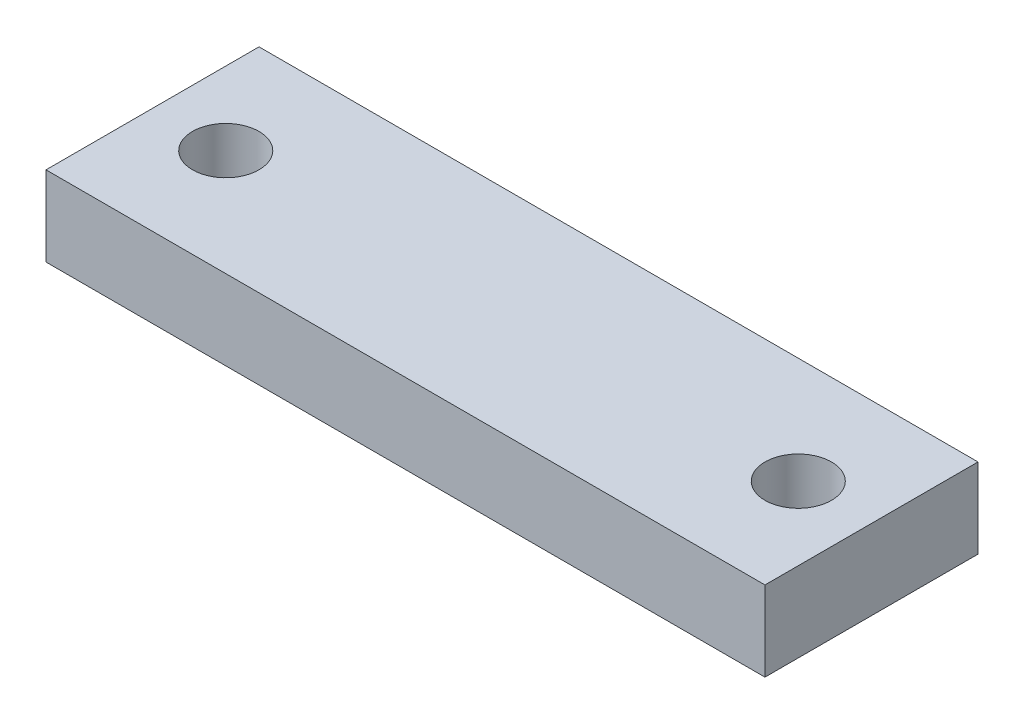
ISO-10303-21;
HEADER;
FILE_DESCRIPTION(('STEP AP214'),'2;1');
FILE_NAME('part.step','',(''),(''),'','','');
FILE_SCHEMA(('AUTOMOTIVE_DESIGN { 1 0 10303 214 1 1 1 1 }'));
ENDSEC;
DATA;
#1=APPLICATION_CONTEXT('core data for automotive mechanical design processes');
#2=APPLICATION_PROTOCOL_DEFINITION('international standard','automotive_design',2000,#1);
#3=PRODUCT_CONTEXT('',#1,'mechanical');
#4=PRODUCT('Part','Part','',(#3));
#5=PRODUCT_RELATED_PRODUCT_CATEGORY('part','',(#4));
#6=PRODUCT_DEFINITION_FORMATION('','',#4);
#7=PRODUCT_DEFINITION_CONTEXT('part definition',#1,'design');
#8=PRODUCT_DEFINITION('design','',#6,#7);
#9=PRODUCT_DEFINITION_SHAPE('','',#8);
#10=(LENGTH_UNIT() NAMED_UNIT(*) SI_UNIT(.MILLI.,.METRE.));
#11=(NAMED_UNIT(*) PLANE_ANGLE_UNIT() SI_UNIT($,.RADIAN.));
#12=(NAMED_UNIT(*) SI_UNIT($,.STERADIAN.) SOLID_ANGLE_UNIT());
#13=UNCERTAINTY_MEASURE_WITH_UNIT(LENGTH_MEASURE(1.E-05),#10,'distance_accuracy_value','');
#14=(GEOMETRIC_REPRESENTATION_CONTEXT(3) GLOBAL_UNCERTAINTY_ASSIGNED_CONTEXT((#13)) GLOBAL_UNIT_ASSIGNED_CONTEXT((#10,
#11,#12)) REPRESENTATION_CONTEXT('',''));
#15=CARTESIAN_POINT('',(0.,0.,0.));
#16=DIRECTION('',(0.,0.,1.));
#17=DIRECTION('',(1.,0.,0.));
#18=AXIS2_PLACEMENT_3D('',#15,#16,#17);
#19=CARTESIAN_POINT('',(0.,9.525,-25.4));
#20=DIRECTION('',(0.,-1.,0.));
#21=DIRECTION('',(0.,0.,-1.));
#22=AXIS2_PLACEMENT_3D('',#19,#20,#21);
#23=PLANE('',#22);
#24=CARTESIAN_POINT('',(76.99375,9.525,-12.7));
#25=DIRECTION('',(0.,1.,0.));
#26=DIRECTION('',(0.,0.,1.));
#27=AXIS2_PLACEMENT_3D('',#24,#25,#26);
#28=CIRCLE('',#27,3.96874999999999);
#29=CARTESIAN_POINT('',(76.99375,9.525,-8.73125000000002));
#30=VERTEX_POINT('',#29);
#31=EDGE_CURVE('E90',#30,#30,#28,.T.);
#32=ORIENTED_EDGE('',*,*,#31,.F.);
#33=EDGE_LOOP('',(#32));
#34=FACE_BOUND('',#33,.T.);
#35=DIRECTION('',(0.,0.,1.));
#36=VECTOR('',#35,1.);
#37=CARTESIAN_POINT('',(0.,9.525,0.));
#38=LINE('',#37,#36);
#39=CARTESIAN_POINT('',(0.,9.525,-25.4));
#40=VERTEX_POINT('',#39);
#41=CARTESIAN_POINT('',(0.,9.525,0.));
#42=VERTEX_POINT('',#41);
#43=EDGE_CURVE('E100',#40,#42,#38,.T.);
#44=ORIENTED_EDGE('',*,*,#43,.T.);
#45=DIRECTION('',(1.,0.,0.));
#46=VECTOR('',#45,1.);
#47=CARTESIAN_POINT('',(0.,9.525,0.));
#48=LINE('',#47,#46);
#49=CARTESIAN_POINT('',(85.725,9.525,0.));
#50=VERTEX_POINT('',#49);
#51=EDGE_CURVE('E85',#42,#50,#48,.T.);
#52=ORIENTED_EDGE('',*,*,#51,.T.);
#53=DIRECTION('',(0.,0.,-1.));
#54=VECTOR('',#53,1.);
#55=CARTESIAN_POINT('',(85.725,9.525,0.));
#56=LINE('',#55,#54);
#57=CARTESIAN_POINT('',(85.725,9.525,-25.4));
#58=VERTEX_POINT('',#57);
#59=EDGE_CURVE('E51',#50,#58,#56,.T.);
#60=ORIENTED_EDGE('',*,*,#59,.T.);
#61=DIRECTION('',(-1.,0.,0.));
#62=VECTOR('',#61,1.);
#63=CARTESIAN_POINT('',(0.,9.525,-25.4));
#64=LINE('',#63,#62);
#65=EDGE_CURVE('E46',#58,#40,#64,.T.);
#66=ORIENTED_EDGE('',*,*,#65,.T.);
#67=EDGE_LOOP('',(#44,#52,#60,#66));
#68=FACE_BOUND('',#67,.T.);
#69=CARTESIAN_POINT('',(8.73124999999998,9.525,-12.7));
#70=DIRECTION('',(0.,1.,0.));
#71=DIRECTION('',(0.,0.,1.));
#72=AXIS2_PLACEMENT_3D('',#69,#70,#71);
#73=CIRCLE('',#72,3.96875);
#74=CARTESIAN_POINT('',(8.73124999999998,9.525,-8.73125000000001));
#75=VERTEX_POINT('',#74);
#76=EDGE_CURVE('E118',#75,#75,#73,.T.);
#77=ORIENTED_EDGE('',*,*,#76,.F.);
#78=EDGE_LOOP('',(#77));
#79=FACE_BOUND('',#78,.T.);
#80=ADVANCED_FACE('F31',(#34,#68,#79),#23,.F.);
#81=CARTESIAN_POINT('',(0.,0.,-25.4));
#82=DIRECTION('',(0.,-1.,0.));
#83=DIRECTION('',(0.,0.,-1.));
#84=AXIS2_PLACEMENT_3D('',#81,#82,#83);
#85=PLANE('',#84);
#86=CARTESIAN_POINT('',(76.99375,0.,-12.7));
#87=DIRECTION('',(0.,1.,0.));
#88=DIRECTION('',(0.,0.,1.));
#89=AXIS2_PLACEMENT_3D('',#86,#87,#88);
#90=CIRCLE('',#89,3.96874999999999);
#91=CARTESIAN_POINT('',(76.99375,0.,-8.73125000000002));
#92=VERTEX_POINT('',#91);
#93=EDGE_CURVE('E93',#92,#92,#90,.T.);
#94=ORIENTED_EDGE('',*,*,#93,.T.);
#95=EDGE_LOOP('',(#94));
#96=FACE_BOUND('',#95,.T.);
#97=DIRECTION('',(0.,0.,1.));
#98=VECTOR('',#97,1.);
#99=CARTESIAN_POINT('',(0.,0.,0.));
#100=LINE('',#99,#98);
#101=CARTESIAN_POINT('',(0.,0.,-25.4));
#102=VERTEX_POINT('',#101);
#103=CARTESIAN_POINT('',(0.,0.,0.));
#104=VERTEX_POINT('',#103);
#105=EDGE_CURVE('E77',#102,#104,#100,.T.);
#106=ORIENTED_EDGE('',*,*,#105,.F.);
#107=DIRECTION('',(-1.,0.,0.));
#108=VECTOR('',#107,1.);
#109=CARTESIAN_POINT('',(0.,0.,-25.4));
#110=LINE('',#109,#108);
#111=CARTESIAN_POINT('',(85.725,0.,-25.4));
#112=VERTEX_POINT('',#111);
#113=EDGE_CURVE('E98',#112,#102,#110,.T.);
#114=ORIENTED_EDGE('',*,*,#113,.F.);
#115=DIRECTION('',(0.,0.,-1.));
#116=VECTOR('',#115,1.);
#117=CARTESIAN_POINT('',(85.725,0.,0.));
#118=LINE('',#117,#116);
#119=CARTESIAN_POINT('',(85.725,0.,0.));
#120=VERTEX_POINT('',#119);
#121=EDGE_CURVE('E78',#120,#112,#118,.T.);
#122=ORIENTED_EDGE('',*,*,#121,.F.);
#123=DIRECTION('',(1.,0.,0.));
#124=VECTOR('',#123,1.);
#125=CARTESIAN_POINT('',(0.,0.,0.));
#126=LINE('',#125,#124);
#127=EDGE_CURVE('E72',#104,#120,#126,.T.);
#128=ORIENTED_EDGE('',*,*,#127,.F.);
#129=EDGE_LOOP('',(#106,#114,#122,#128));
#130=FACE_BOUND('',#129,.T.);
#131=CARTESIAN_POINT('',(8.73124999999998,0.,-12.7));
#132=DIRECTION('',(0.,1.,0.));
#133=DIRECTION('',(0.,0.,1.));
#134=AXIS2_PLACEMENT_3D('',#131,#132,#133);
#135=CIRCLE('',#134,3.96875);
#136=CARTESIAN_POINT('',(8.73124999999998,0.,-8.73125000000001));
#137=VERTEX_POINT('',#136);
#138=EDGE_CURVE('E120',#137,#137,#135,.T.);
#139=ORIENTED_EDGE('',*,*,#138,.T.);
#140=EDGE_LOOP('',(#139));
#141=FACE_BOUND('',#140,.T.);
#142=ADVANCED_FACE('F73',(#96,#130,#141),#85,.T.);
#143=CARTESIAN_POINT('',(0.,9.525,0.));
#144=DIRECTION('',(1.,0.,0.));
#145=DIRECTION('',(0.,0.,-1.));
#146=AXIS2_PLACEMENT_3D('',#143,#144,#145);
#147=PLANE('',#146);
#148=ORIENTED_EDGE('',*,*,#105,.T.);
#149=DIRECTION('',(0.,-1.,0.));
#150=VECTOR('',#149,1.);
#151=CARTESIAN_POINT('',(0.,9.525,0.));
#152=LINE('',#151,#150);
#153=EDGE_CURVE('E11',#42,#104,#152,.T.);
#154=ORIENTED_EDGE('',*,*,#153,.F.);
#155=ORIENTED_EDGE('',*,*,#43,.F.);
#156=DIRECTION('',(0.,-1.,0.));
#157=VECTOR('',#156,1.);
#158=CARTESIAN_POINT('',(0.,9.525,-25.4));
#159=LINE('',#158,#157);
#160=EDGE_CURVE('E89',#40,#102,#159,.T.);
#161=ORIENTED_EDGE('',*,*,#160,.T.);
#162=EDGE_LOOP('',(#148,#154,#155,#161));
#163=FACE_BOUND('',#162,.T.);
#164=ADVANCED_FACE('F33',(#163),#147,.F.);
#165=CARTESIAN_POINT('',(0.,9.525,0.));
#166=DIRECTION('',(0.,0.,-1.));
#167=DIRECTION('',(-1.,0.,0.));
#168=AXIS2_PLACEMENT_3D('',#165,#166,#167);
#169=PLANE('',#168);
#170=ORIENTED_EDGE('',*,*,#127,.T.);
#171=DIRECTION('',(0.,-1.,0.));
#172=VECTOR('',#171,1.);
#173=CARTESIAN_POINT('',(85.725,9.525,0.));
#174=LINE('',#173,#172);
#175=EDGE_CURVE('E39',#50,#120,#174,.T.);
#176=ORIENTED_EDGE('',*,*,#175,.F.);
#177=ORIENTED_EDGE('',*,*,#51,.F.);
#178=ORIENTED_EDGE('',*,*,#153,.T.);
#179=EDGE_LOOP('',(#170,#176,#177,#178));
#180=FACE_BOUND('',#179,.T.);
#181=ADVANCED_FACE('F84',(#180),#169,.F.);
#182=CARTESIAN_POINT('',(85.725,9.525,0.));
#183=DIRECTION('',(-1.,0.,0.));
#184=DIRECTION('',(0.,0.,1.));
#185=AXIS2_PLACEMENT_3D('',#182,#183,#184);
#186=PLANE('',#185);
#187=ORIENTED_EDGE('',*,*,#121,.T.);
#188=DIRECTION('',(0.,-1.,0.));
#189=VECTOR('',#188,1.);
#190=CARTESIAN_POINT('',(85.725,9.525,-25.4));
#191=LINE('',#190,#189);
#192=EDGE_CURVE('E106',#58,#112,#191,.T.);
#193=ORIENTED_EDGE('',*,*,#192,.F.);
#194=ORIENTED_EDGE('',*,*,#59,.F.);
#195=ORIENTED_EDGE('',*,*,#175,.T.);
#196=EDGE_LOOP('',(#187,#193,#194,#195));
#197=FACE_BOUND('',#196,.T.);
#198=ADVANCED_FACE('F109',(#197),#186,.F.);
#199=CARTESIAN_POINT('',(0.,9.525,-25.4));
#200=DIRECTION('',(0.,0.,1.));
#201=DIRECTION('',(1.,0.,0.));
#202=AXIS2_PLACEMENT_3D('',#199,#200,#201);
#203=PLANE('',#202);
#204=ORIENTED_EDGE('',*,*,#113,.T.);
#205=ORIENTED_EDGE('',*,*,#160,.F.);
#206=ORIENTED_EDGE('',*,*,#65,.F.);
#207=ORIENTED_EDGE('',*,*,#192,.T.);
#208=EDGE_LOOP('',(#204,#205,#206,#207));
#209=FACE_BOUND('',#208,.T.);
#210=ADVANCED_FACE('F111',(#209),#203,.F.);
#211=CARTESIAN_POINT('',(76.99375,9.525,-12.7));
#212=DIRECTION('',(0.,-1.,0.));
#213=DIRECTION('',(0.,0.,-1.));
#214=AXIS2_PLACEMENT_3D('',#211,#212,#213);
#215=CYLINDRICAL_SURFACE('',#214,3.96874999999999);
#216=ORIENTED_EDGE('',*,*,#31,.T.);
#217=EDGE_LOOP('',(#216));
#218=FACE_BOUND('',#217,.T.);
#219=ORIENTED_EDGE('',*,*,#93,.F.);
#220=EDGE_LOOP('',(#219));
#221=FACE_BOUND('',#220,.T.);
#222=ADVANCED_FACE('F129',(#218,#221),#215,.F.);
#223=CARTESIAN_POINT('',(8.73124999999998,9.525,-12.7));
#224=DIRECTION('',(0.,-1.,0.));
#225=DIRECTION('',(0.,0.,-1.));
#226=AXIS2_PLACEMENT_3D('',#223,#224,#225);
#227=CYLINDRICAL_SURFACE('',#226,3.96875);
#228=ORIENTED_EDGE('',*,*,#76,.T.);
#229=EDGE_LOOP('',(#228));
#230=FACE_BOUND('',#229,.T.);
#231=ORIENTED_EDGE('',*,*,#138,.F.);
#232=EDGE_LOOP('',(#231));
#233=FACE_BOUND('',#232,.T.);
#234=ADVANCED_FACE('F127',(#230,#233),#227,.F.);
#235=CLOSED_SHELL('',(#80,#142,#164,#181,#198,#210,#222,#234));
#236=MANIFOLD_SOLID_BREP('B2',#235);
#237=ADVANCED_BREP_SHAPE_REPRESENTATION('',(#18,#236),#14);
#238=SHAPE_DEFINITION_REPRESENTATION(#9,#237);
ENDSEC;
END-ISO-10303-21;
